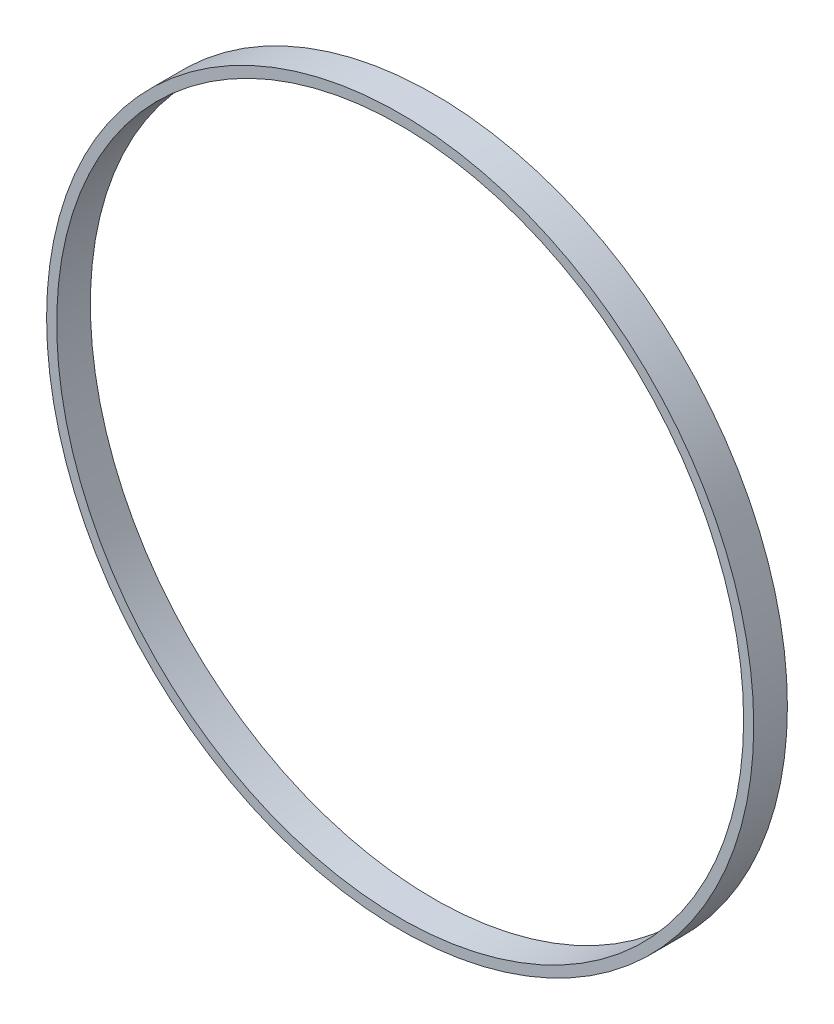
ISO-10303-21;
HEADER;
FILE_DESCRIPTION(('STEP AP214'),'2;1');
FILE_NAME('part.step','',(''),(''),'','','');
FILE_SCHEMA(('AUTOMOTIVE_DESIGN { 1 0 10303 214 1 1 1 1 }'));
ENDSEC;
DATA;
#1=APPLICATION_CONTEXT('core data for automotive mechanical design processes');
#2=APPLICATION_PROTOCOL_DEFINITION('international standard','automotive_design',2000,#1);
#3=PRODUCT_CONTEXT('',#1,'mechanical');
#4=PRODUCT('Part','Part','',(#3));
#5=PRODUCT_RELATED_PRODUCT_CATEGORY('part','',(#4));
#6=PRODUCT_DEFINITION_FORMATION('','',#4);
#7=PRODUCT_DEFINITION_CONTEXT('part definition',#1,'design');
#8=PRODUCT_DEFINITION('design','',#6,#7);
#9=PRODUCT_DEFINITION_SHAPE('','',#8);
#10=(LENGTH_UNIT() NAMED_UNIT(*) SI_UNIT(.MILLI.,.METRE.));
#11=(NAMED_UNIT(*) PLANE_ANGLE_UNIT() SI_UNIT($,.RADIAN.));
#12=(NAMED_UNIT(*) SI_UNIT($,.STERADIAN.) SOLID_ANGLE_UNIT());
#13=UNCERTAINTY_MEASURE_WITH_UNIT(LENGTH_MEASURE(1.E-05),#10,'distance_accuracy_value','');
#14=(GEOMETRIC_REPRESENTATION_CONTEXT(3) GLOBAL_UNCERTAINTY_ASSIGNED_CONTEXT((#13)) GLOBAL_UNIT_ASSIGNED_CONTEXT((#10,
#11,#12)) REPRESENTATION_CONTEXT('',''));
#15=CARTESIAN_POINT('',(0.,0.,0.));
#16=DIRECTION('',(0.,0.,1.));
#17=DIRECTION('',(1.,0.,0.));
#18=AXIS2_PLACEMENT_3D('',#15,#16,#17);
#19=CARTESIAN_POINT('',(0.,0.,5.));
#20=DIRECTION('',(0.,0.,1.));
#21=DIRECTION('',(1.,0.,0.));
#22=AXIS2_PLACEMENT_3D('',#19,#20,#21);
#23=PLANE('',#22);
#24=CARTESIAN_POINT('',(0.,0.,5.));
#25=DIRECTION('',(0.,0.,1.));
#26=DIRECTION('',(1.,0.,0.));
#27=AXIS2_PLACEMENT_3D('',#24,#25,#26);
#28=CIRCLE('',#27,52.5);
#29=CARTESIAN_POINT('',(52.5,0.,5.));
#30=VERTEX_POINT('',#29);
#31=EDGE_CURVE('E10',#30,#30,#28,.T.);
#32=ORIENTED_EDGE('',*,*,#31,.T.);
#33=EDGE_LOOP('',(#32));
#34=FACE_BOUND('',#33,.T.);
#35=CARTESIAN_POINT('',(0.,0.,5.));
#36=DIRECTION('',(0.,0.,1.));
#37=DIRECTION('',(1.,0.,0.));
#38=AXIS2_PLACEMENT_3D('',#35,#36,#37);
#39=CIRCLE('',#38,51.);
#40=CARTESIAN_POINT('',(51.,0.,5.));
#41=VERTEX_POINT('',#40);
#42=EDGE_CURVE('E41',#41,#41,#39,.T.);
#43=ORIENTED_EDGE('',*,*,#42,.F.);
#44=EDGE_LOOP('',(#43));
#45=FACE_BOUND('',#44,.T.);
#46=ADVANCED_FACE('F30',(#34,#45),#23,.T.);
#47=CARTESIAN_POINT('',(0.,0.,0.));
#48=DIRECTION('',(0.,0.,1.));
#49=DIRECTION('',(1.,0.,0.));
#50=AXIS2_PLACEMENT_3D('',#47,#48,#49);
#51=PLANE('',#50);
#52=CARTESIAN_POINT('',(0.,0.,0.));
#53=DIRECTION('',(0.,0.,1.));
#54=DIRECTION('',(1.,0.,0.));
#55=AXIS2_PLACEMENT_3D('',#52,#53,#54);
#56=CIRCLE('',#55,52.5);
#57=CARTESIAN_POINT('',(52.5,0.,0.));
#58=VERTEX_POINT('',#57);
#59=EDGE_CURVE('E34',#58,#58,#56,.T.);
#60=ORIENTED_EDGE('',*,*,#59,.F.);
#61=EDGE_LOOP('',(#60));
#62=FACE_BOUND('',#61,.T.);
#63=CARTESIAN_POINT('',(0.,0.,0.));
#64=DIRECTION('',(0.,0.,1.));
#65=DIRECTION('',(1.,0.,0.));
#66=AXIS2_PLACEMENT_3D('',#63,#64,#65);
#67=CIRCLE('',#66,51.);
#68=CARTESIAN_POINT('',(51.,0.,0.));
#69=VERTEX_POINT('',#68);
#70=EDGE_CURVE('E43',#69,#69,#67,.T.);
#71=ORIENTED_EDGE('',*,*,#70,.T.);
#72=EDGE_LOOP('',(#71));
#73=FACE_BOUND('',#72,.T.);
#74=ADVANCED_FACE('F53',(#62,#73),#51,.F.);
#75=CARTESIAN_POINT('',(0.,0.,5.));
#76=DIRECTION('',(0.,0.,-1.));
#77=DIRECTION('',(-1.,0.,0.));
#78=AXIS2_PLACEMENT_3D('',#75,#76,#77);
#79=CYLINDRICAL_SURFACE('',#78,52.5);
#80=ORIENTED_EDGE('',*,*,#31,.F.);
#81=EDGE_LOOP('',(#80));
#82=FACE_BOUND('',#81,.T.);
#83=ORIENTED_EDGE('',*,*,#59,.T.);
#84=EDGE_LOOP('',(#83));
#85=FACE_BOUND('',#84,.T.);
#86=ADVANCED_FACE('F32',(#82,#85),#79,.T.);
#87=CARTESIAN_POINT('',(0.,0.,5.));
#88=DIRECTION('',(0.,0.,-1.));
#89=DIRECTION('',(-1.,0.,0.));
#90=AXIS2_PLACEMENT_3D('',#87,#88,#89);
#91=CYLINDRICAL_SURFACE('',#90,51.);
#92=ORIENTED_EDGE('',*,*,#42,.T.);
#93=EDGE_LOOP('',(#92));
#94=FACE_BOUND('',#93,.T.);
#95=ORIENTED_EDGE('',*,*,#70,.F.);
#96=EDGE_LOOP('',(#95));
#97=FACE_BOUND('',#96,.T.);
#98=ADVANCED_FACE('F49',(#94,#97),#91,.F.);
#99=CLOSED_SHELL('',(#46,#74,#86,#98));
#100=MANIFOLD_SOLID_BREP('B2',#99);
#101=ADVANCED_BREP_SHAPE_REPRESENTATION('',(#18,#100),#14);
#102=SHAPE_DEFINITION_REPRESENTATION(#9,#101);
ENDSEC;
END-ISO-10303-21;
